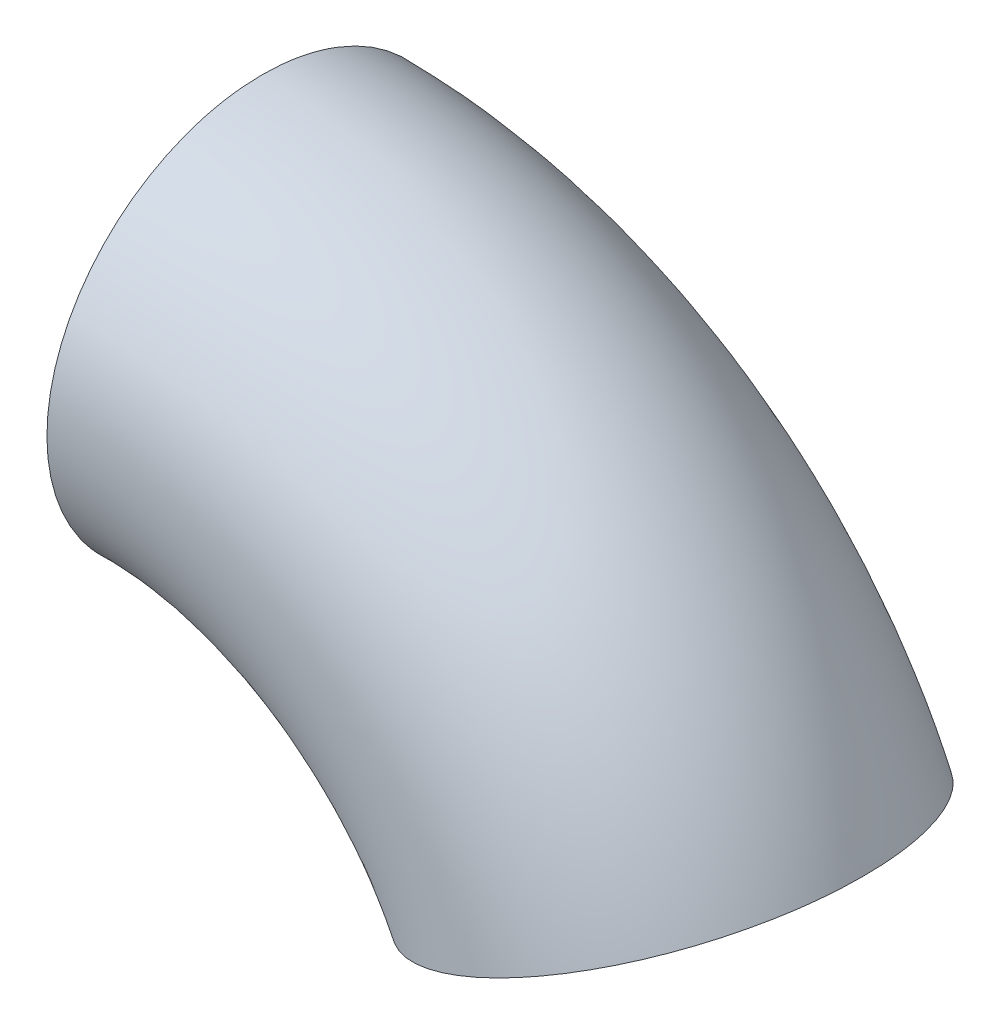
ISO-10303-21;
HEADER;
FILE_DESCRIPTION(('STEP AP214'),'2;1');
FILE_NAME('part.step','',(''),(''),'','','');
FILE_SCHEMA(('AUTOMOTIVE_DESIGN { 1 0 10303 214 1 1 1 1 }'));
ENDSEC;
DATA;
#1=APPLICATION_CONTEXT('core data for automotive mechanical design processes');
#2=APPLICATION_PROTOCOL_DEFINITION('international standard','automotive_design',2000,#1);
#3=PRODUCT_CONTEXT('',#1,'mechanical');
#4=PRODUCT('Part','Part','',(#3));
#5=PRODUCT_RELATED_PRODUCT_CATEGORY('part','',(#4));
#6=PRODUCT_DEFINITION_FORMATION('','',#4);
#7=PRODUCT_DEFINITION_CONTEXT('part definition',#1,'design');
#8=PRODUCT_DEFINITION('design','',#6,#7);
#9=PRODUCT_DEFINITION_SHAPE('','',#8);
#10=(LENGTH_UNIT() NAMED_UNIT(*) SI_UNIT(.MILLI.,.METRE.));
#11=(NAMED_UNIT(*) PLANE_ANGLE_UNIT() SI_UNIT($,.RADIAN.));
#12=(NAMED_UNIT(*) SI_UNIT($,.STERADIAN.) SOLID_ANGLE_UNIT());
#13=UNCERTAINTY_MEASURE_WITH_UNIT(LENGTH_MEASURE(1.E-05),#10,'distance_accuracy_value','');
#14=(GEOMETRIC_REPRESENTATION_CONTEXT(3) GLOBAL_UNCERTAINTY_ASSIGNED_CONTEXT((#13)) GLOBAL_UNIT_ASSIGNED_CONTEXT((#10,
#11,#12)) REPRESENTATION_CONTEXT('',''));
#15=CARTESIAN_POINT('',(0.,0.,0.));
#16=DIRECTION('',(0.,0.,1.));
#17=DIRECTION('',(1.,0.,0.));
#18=AXIS2_PLACEMENT_3D('',#15,#16,#17);
#19=CARTESIAN_POINT('',(0.888030977253935,19.9802752979892,0.));
#20=CARTESIAN_POINT('',(26.8447340893192,19.6255467849875,0.));
#21=CARTESIAN_POINT('',(48.554883928942,5.39369298068787,0.));
#22=CARTESIAN_POINT('',(59.2333664266203,-18.2673780075961,0.));
#23=CARTESIAN_POINT('',(0.888030977253935,19.9802752979892,40.));
#24=CARTESIAN_POINT('',(26.8447340893192,19.6255467849875,40.));
#25=CARTESIAN_POINT('',(48.554883928942,5.39369298068787,40.));
#26=CARTESIAN_POINT('',(59.2333664266203,-18.2673780075961,40.));
#27=CARTESIAN_POINT('',(-0.888030977253935,-19.9802752979892,40.));
#28=CARTESIAN_POINT('',(9.10622594236543,-19.6255467849875,40.));
#29=CARTESIAN_POINT('',(17.7291254676408,-24.690781969093,40.));
#30=CARTESIAN_POINT('',(22.2857365492219,-33.5929333464011,40.));
#31=CARTESIAN_POINT('',(-0.888030977253935,-19.9802752979892,0.));
#32=CARTESIAN_POINT('',(9.10622594236542,-19.6255467849875,0.));
#33=CARTESIAN_POINT('',(17.7291254676408,-24.690781969093,0.));
#34=CARTESIAN_POINT('',(22.2857365492219,-33.5929333464011,0.));
#35=CARTESIAN_POINT('',(-0.888030977253935,-19.9802752979892,-40.));
#36=CARTESIAN_POINT('',(9.10622594236542,-19.6255467849875,-40.));
#37=CARTESIAN_POINT('',(17.7291254676408,-24.690781969093,-40.));
#38=CARTESIAN_POINT('',(22.2857365492219,-33.5929333464011,-40.));
#39=CARTESIAN_POINT('',(0.888030977253935,19.9802752979892,-40.));
#40=CARTESIAN_POINT('',(26.8447340893192,19.6255467849875,-40.));
#41=CARTESIAN_POINT('',(48.554883928942,5.39369298068787,-40.));
#42=CARTESIAN_POINT('',(59.2333664266203,-18.2673780075961,-40.));
#43=CARTESIAN_POINT('',(0.888030977253935,19.9802752979892,0.));
#44=CARTESIAN_POINT('',(26.8447340893192,19.6255467849875,0.));
#45=CARTESIAN_POINT('',(48.554883928942,5.39369298068787,0.));
#46=CARTESIAN_POINT('',(59.2333664266203,-18.2673780075961,0.));
#47=(BOUNDED_SURFACE() B_SPLINE_SURFACE(3,3,((#19,#20,#21,#22),(#23,#24,#25,#26),(#27,#28,#29,
#30),(#31,#32,#33,#34),(#35,#36,#37,#38),(#39,#40,#41,#42),(#43,#44,#45,#46)),.UNSPECIFIED.,.T.,
.F.,.F.) B_SPLINE_SURFACE_WITH_KNOTS((4,3,4),(4,4),(0.,0.5,1.),(0.,1.),
.UNSPECIFIED.) GEOMETRIC_REPRESENTATION_ITEM() RATIONAL_B_SPLINE_SURFACE(((1.,0.895822704746779,
0.895822704746779,1.),(0.333333333333333,0.298607568248926,0.298607568248926,0.333333333333333),
(0.333333333333333,0.298607568248926,0.298607568248926,0.333333333333333),(1.,0.895822704746779,
0.895822704746779,1.),(0.333333333333333,0.298607568248926,0.298607568248926,0.333333333333333),
(0.333333333333333,0.298607568248926,0.298607568248926,0.333333333333333),(1.,0.895822704746779,
0.895822704746779,1.))) REPRESENTATION_ITEM('') SURFACE());
#48=CARTESIAN_POINT('',(40.7595514879211,-25.9301556769986,0.));
#49=DIRECTION('',(0.383138883470126,-0.923690746934961,0.));
#50=DIRECTION('',(0.92369074693496,0.383138883470126,0.));
#51=AXIS2_PLACEMENT_3D('',#48,#49,#50);
#52=CIRCLE('',#51,20.);
#53=CARTESIAN_POINT('',(59.2333664266203,-18.2673780075961,0.));
#54=VERTEX_POINT('',#53);
#55=EDGE_CURVE('E62',#54,#54,#52,.T.);
#56=CARTESIAN_POINT('',(0.,0.,0.));
#57=DIRECTION('',(0.99901376489946,-0.0444015488626968,0.));
#58=DIRECTION('',(0.0444015488626968,0.99901376489946,0.));
#59=AXIS2_PLACEMENT_3D('',#56,#57,#58);
#60=CIRCLE('',#59,20.);
#61=CARTESIAN_POINT('',(0.888030977253935,19.9802752979892,0.));
#62=VERTEX_POINT('',#61);
#63=EDGE_CURVE('E46',#62,#62,#60,.T.);
#64=ORIENTED_EDGE('',*,*,#55,.F.);
#65=EDGE_LOOP('',(#64));
#66=FACE_BOUND('',#65,.T.);
#67=ORIENTED_EDGE('',*,*,#63,.T.);
#68=EDGE_LOOP('',(#67));
#69=FACE_BOUND('',#68,.T.);
#70=ADVANCED_FACE('F41',(#66,#69),#47,.T.);
#71=CARTESIAN_POINT('',(0.,0.,0.));
#72=DIRECTION('',(0.99901376489946,-0.0444015488626968,0.));
#73=DIRECTION('',(0.0444015488626968,0.99901376489946,0.));
#74=AXIS2_PLACEMENT_3D('',#71,#72,#73);
#75=PLANE('',#74);
#76=CARTESIAN_POINT('',(0.,0.,0.));
#77=DIRECTION('',(0.99901376489946,-0.0444015488626968,0.));
#78=DIRECTION('',(0.0444015488626968,0.99901376489946,0.));
#79=AXIS2_PLACEMENT_3D('',#76,#77,#78);
#80=CIRCLE('',#79,19.5);
#81=CARTESIAN_POINT('',(0.865830202822587,19.4807684155395,0.));
#82=VERTEX_POINT('',#81);
#83=EDGE_CURVE('E52',#82,#82,#80,.F.);
#84=ORIENTED_EDGE('',*,*,#83,.F.);
#85=EDGE_LOOP('',(#84));
#86=FACE_BOUND('',#85,.T.);
#87=ORIENTED_EDGE('',*,*,#63,.F.);
#88=EDGE_LOOP('',(#87));
#89=FACE_BOUND('',#88,.T.);
#90=ADVANCED_FACE('F83',(#86,#89),#75,.F.);
#91=CARTESIAN_POINT('',(40.7595514879211,-25.9301556769986,0.));
#92=DIRECTION('',(0.383138883470126,-0.923690746934961,0.));
#93=DIRECTION('',(0.92369074693496,0.383138883470126,0.));
#94=AXIS2_PLACEMENT_3D('',#91,#92,#93);
#95=PLANE('',#94);
#96=CARTESIAN_POINT('',(40.7595514879211,-25.9301556769986,0.));
#97=DIRECTION('',(0.383138883470126,-0.923690746934961,0.));
#98=DIRECTION('',(0.92369074693496,0.383138883470126,0.));
#99=AXIS2_PLACEMENT_3D('',#96,#97,#98);
#100=CIRCLE('',#99,19.5);
#101=CARTESIAN_POINT('',(58.7715210531528,-18.4589474493312,0.));
#102=VERTEX_POINT('',#101);
#103=EDGE_CURVE('E11',#102,#102,#100,.F.);
#104=ORIENTED_EDGE('',*,*,#103,.T.);
#105=EDGE_LOOP('',(#104));
#106=FACE_BOUND('',#105,.T.);
#107=ORIENTED_EDGE('',*,*,#55,.T.);
#108=EDGE_LOOP('',(#107));
#109=FACE_BOUND('',#108,.T.);
#110=ADVANCED_FACE('F69',(#106,#109),#95,.T.);
#111=CARTESIAN_POINT('',(0.865830202822587,19.4807684155395,0.));
#112=CARTESIAN_POINT('',(26.6230027374823,19.1349081153628,0.));
#113=CARTESIAN_POINT('',(48.1695619481757,5.0176370438156,0.));
#114=CARTESIAN_POINT('',(58.7715210531528,-18.4589474493312,0.));
#115=CARTESIAN_POINT('',(0.865830202822587,19.4807684155395,-39.));
#116=CARTESIAN_POINT('',(26.6230027374823,19.1349081153628,-39.));
#117=CARTESIAN_POINT('',(48.1695619481757,5.0176370438156,-39.));
#118=CARTESIAN_POINT('',(58.7715210531528,-18.4589474493312,-39.));
#119=CARTESIAN_POINT('',(-0.865830202822587,-19.4807684155395,-39.));
#120=CARTESIAN_POINT('',(9.32795729420234,-19.1349081153628,-39.));
#121=CARTESIAN_POINT('',(18.1144474484071,-24.3147260322208,-39.));
#122=CARTESIAN_POINT('',(22.7475819226894,-33.4013639046661,-39.));
#123=CARTESIAN_POINT('',(-0.865830202822587,-19.4807684155395,0.));
#124=CARTESIAN_POINT('',(9.32795729420235,-19.1349081153628,0.));
#125=CARTESIAN_POINT('',(18.1144474484071,-24.3147260322208,0.));
#126=CARTESIAN_POINT('',(22.7475819226894,-33.4013639046661,0.));
#127=CARTESIAN_POINT('',(-0.865830202822586,-19.4807684155395,39.));
#128=CARTESIAN_POINT('',(9.32795729420235,-19.1349081153628,39.));
#129=CARTESIAN_POINT('',(18.1144474484071,-24.3147260322208,39.));
#130=CARTESIAN_POINT('',(22.7475819226894,-33.4013639046661,39.));
#131=CARTESIAN_POINT('',(0.865830202822587,19.4807684155395,39.));
#132=CARTESIAN_POINT('',(26.6230027374823,19.1349081153628,39.));
#133=CARTESIAN_POINT('',(48.1695619481757,5.0176370438156,39.));
#134=CARTESIAN_POINT('',(58.7715210531528,-18.4589474493312,39.));
#135=CARTESIAN_POINT('',(0.865830202822587,19.4807684155395,0.));
#136=CARTESIAN_POINT('',(26.6230027374823,19.1349081153628,0.));
#137=CARTESIAN_POINT('',(48.1695619481757,5.0176370438156,0.));
#138=CARTESIAN_POINT('',(58.7715210531528,-18.4589474493312,0.));
#139=(BOUNDED_SURFACE() B_SPLINE_SURFACE(3,3,((#111,#112,#113,#114),(#115,#116,#117,#118),(#119,
#120,#121,#122),(#123,#124,#125,#126),(#127,#128,#129,#130),(#131,#132,#133,#134),(#135,#136,
#137,#138)),.UNSPECIFIED.,.T.,.F.,.F.) B_SPLINE_SURFACE_WITH_KNOTS((4,3,4),(4,4),(0.,0.5,1.),
(0.,1.),.UNSPECIFIED.) GEOMETRIC_REPRESENTATION_ITEM() RATIONAL_B_SPLINE_SURFACE(((1.,
0.895822704746779,0.895822704746779,1.),(0.333333333333333,0.298607568248926,0.298607568248926,
0.333333333333333),(0.333333333333333,0.298607568248926,0.298607568248926,0.333333333333333),
(1.,0.895822704746779,0.895822704746779,1.),(0.333333333333333,0.298607568248926,
0.298607568248926,0.333333333333333),(0.333333333333333,0.298607568248926,0.298607568248926,
0.333333333333333),(1.,0.895822704746779,0.895822704746779,1.))) REPRESENTATION_ITEM('') SURFACE());
#140=ORIENTED_EDGE('',*,*,#103,.F.);
#141=EDGE_LOOP('',(#140));
#142=FACE_BOUND('',#141,.T.);
#143=ORIENTED_EDGE('',*,*,#83,.T.);
#144=EDGE_LOOP('',(#143));
#145=FACE_BOUND('',#144,.T.);
#146=ADVANCED_FACE('F72',(#142,#145),#139,.T.);
#147=CLOSED_SHELL('',(#70,#90,#110,#146));
#148=MANIFOLD_SOLID_BREP('B2',#147);
#149=ADVANCED_BREP_SHAPE_REPRESENTATION('',(#18,#148),#14);
#150=SHAPE_DEFINITION_REPRESENTATION(#9,#149);
ENDSEC;
END-ISO-10303-21;
